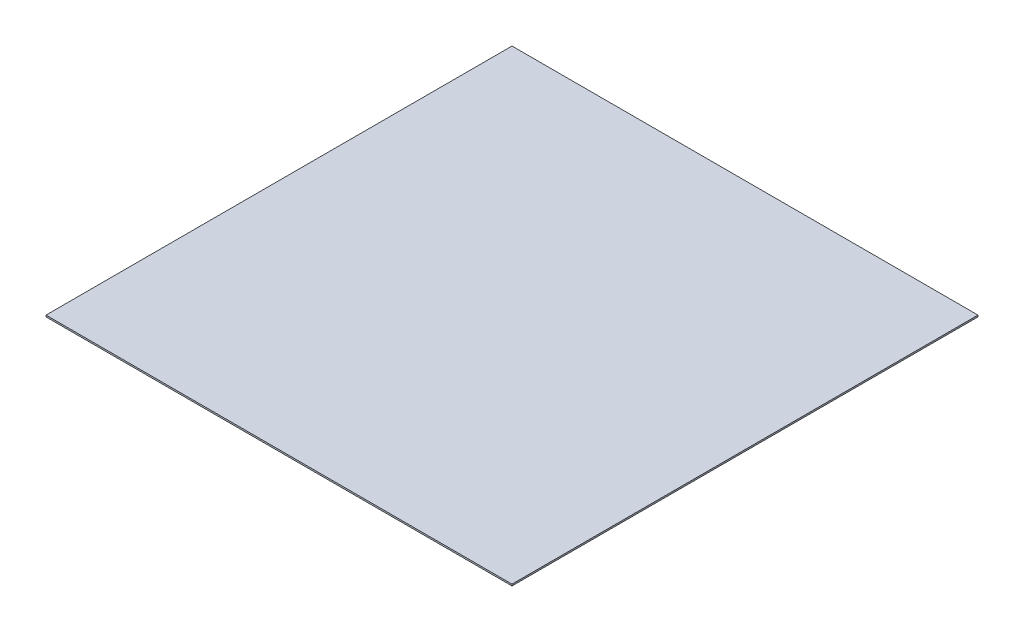
ISO-10303-21;
HEADER;
FILE_DESCRIPTION(('STEP AP214'),'2;1');
FILE_NAME('part.step','',(''),(''),'','','');
FILE_SCHEMA(('AUTOMOTIVE_DESIGN { 1 0 10303 214 1 1 1 1 }'));
ENDSEC;
DATA;
#1=APPLICATION_CONTEXT('core data for automotive mechanical design processes');
#2=APPLICATION_PROTOCOL_DEFINITION('international standard','automotive_design',2000,#1);
#3=PRODUCT_CONTEXT('',#1,'mechanical');
#4=PRODUCT('Part','Part','',(#3));
#5=PRODUCT_RELATED_PRODUCT_CATEGORY('part','',(#4));
#6=PRODUCT_DEFINITION_FORMATION('','',#4);
#7=PRODUCT_DEFINITION_CONTEXT('part definition',#1,'design');
#8=PRODUCT_DEFINITION('design','',#6,#7);
#9=PRODUCT_DEFINITION_SHAPE('','',#8);
#10=(LENGTH_UNIT() NAMED_UNIT(*) SI_UNIT(.MILLI.,.METRE.));
#11=(NAMED_UNIT(*) PLANE_ANGLE_UNIT() SI_UNIT($,.RADIAN.));
#12=(NAMED_UNIT(*) SI_UNIT($,.STERADIAN.) SOLID_ANGLE_UNIT());
#13=UNCERTAINTY_MEASURE_WITH_UNIT(LENGTH_MEASURE(1.E-05),#10,'distance_accuracy_value','');
#14=(GEOMETRIC_REPRESENTATION_CONTEXT(3) GLOBAL_UNCERTAINTY_ASSIGNED_CONTEXT((#13)) GLOBAL_UNIT_ASSIGNED_CONTEXT((#10,
#11,#12)) REPRESENTATION_CONTEXT('',''));
#15=CARTESIAN_POINT('',(0.,0.,0.));
#16=DIRECTION('',(0.,0.,1.));
#17=DIRECTION('',(1.,0.,0.));
#18=AXIS2_PLACEMENT_3D('',#15,#16,#17);
#19=CARTESIAN_POINT('',(-435.,3.,435.));
#20=DIRECTION('',(1.,0.,0.));
#21=DIRECTION('',(0.,0.,-1.));
#22=AXIS2_PLACEMENT_3D('',#19,#20,#21);
#23=PLANE('',#22);
#24=DIRECTION('',(0.,0.,1.));
#25=VECTOR('',#24,1.);
#26=CARTESIAN_POINT('',(-435.,0.,435.));
#27=LINE('',#26,#25);
#28=CARTESIAN_POINT('',(-435.,0.,-435.));
#29=VERTEX_POINT('',#28);
#30=CARTESIAN_POINT('',(-435.,0.,435.));
#31=VERTEX_POINT('',#30);
#32=EDGE_CURVE('E99',#29,#31,#27,.T.);
#33=ORIENTED_EDGE('',*,*,#32,.T.);
#34=DIRECTION('',(0.,-1.,0.));
#35=VECTOR('',#34,1.);
#36=CARTESIAN_POINT('',(-435.,3.,435.));
#37=LINE('',#36,#35);
#38=CARTESIAN_POINT('',(-435.,3.,435.));
#39=VERTEX_POINT('',#38);
#40=EDGE_CURVE('E11',#39,#31,#37,.T.);
#41=ORIENTED_EDGE('',*,*,#40,.F.);
#42=DIRECTION('',(0.,0.,1.));
#43=VECTOR('',#42,1.);
#44=CARTESIAN_POINT('',(-435.,3.,435.));
#45=LINE('',#44,#43);
#46=CARTESIAN_POINT('',(-435.,3.,-435.));
#47=VERTEX_POINT('',#46);
#48=EDGE_CURVE('E87',#47,#39,#45,.T.);
#49=ORIENTED_EDGE('',*,*,#48,.F.);
#50=DIRECTION('',(0.,-1.,0.));
#51=VECTOR('',#50,1.);
#52=CARTESIAN_POINT('',(-435.,3.,-435.));
#53=LINE('',#52,#51);
#54=EDGE_CURVE('E95',#47,#29,#53,.T.);
#55=ORIENTED_EDGE('',*,*,#54,.T.);
#56=EDGE_LOOP('',(#33,#41,#49,#55));
#57=FACE_BOUND('',#56,.T.);
#58=ADVANCED_FACE('F36',(#57),#23,.F.);
#59=CARTESIAN_POINT('',(435.,3.,435.));
#60=DIRECTION('',(0.,0.,-1.));
#61=DIRECTION('',(-1.,0.,0.));
#62=AXIS2_PLACEMENT_3D('',#59,#60,#61);
#63=PLANE('',#62);
#64=DIRECTION('',(1.,0.,0.));
#65=VECTOR('',#64,1.);
#66=CARTESIAN_POINT('',(435.,0.,435.));
#67=LINE('',#66,#65);
#68=CARTESIAN_POINT('',(435.,0.,435.));
#69=VERTEX_POINT('',#68);
#70=EDGE_CURVE('E91',#31,#69,#67,.T.);
#71=ORIENTED_EDGE('',*,*,#70,.T.);
#72=DIRECTION('',(0.,-1.,0.));
#73=VECTOR('',#72,1.);
#74=CARTESIAN_POINT('',(435.,3.,435.));
#75=LINE('',#74,#73);
#76=CARTESIAN_POINT('',(435.,3.,435.));
#77=VERTEX_POINT('',#76);
#78=EDGE_CURVE('E44',#77,#69,#75,.T.);
#79=ORIENTED_EDGE('',*,*,#78,.F.);
#80=DIRECTION('',(1.,0.,0.));
#81=VECTOR('',#80,1.);
#82=CARTESIAN_POINT('',(435.,3.,435.));
#83=LINE('',#82,#81);
#84=EDGE_CURVE('E82',#39,#77,#83,.T.);
#85=ORIENTED_EDGE('',*,*,#84,.F.);
#86=ORIENTED_EDGE('',*,*,#40,.T.);
#87=EDGE_LOOP('',(#71,#79,#85,#86));
#88=FACE_BOUND('',#87,.T.);
#89=ADVANCED_FACE('F90',(#88),#63,.F.);
#90=CARTESIAN_POINT('',(435.,3.,435.));
#91=DIRECTION('',(-1.,0.,0.));
#92=DIRECTION('',(0.,0.,1.));
#93=AXIS2_PLACEMENT_3D('',#90,#91,#92);
#94=PLANE('',#93);
#95=DIRECTION('',(0.,0.,-1.));
#96=VECTOR('',#95,1.);
#97=CARTESIAN_POINT('',(435.,0.,435.));
#98=LINE('',#97,#96);
#99=CARTESIAN_POINT('',(435.,0.,-435.));
#100=VERTEX_POINT('',#99);
#101=EDGE_CURVE('E69',#69,#100,#98,.T.);
#102=ORIENTED_EDGE('',*,*,#101,.T.);
#103=DIRECTION('',(0.,-1.,0.));
#104=VECTOR('',#103,1.);
#105=CARTESIAN_POINT('',(435.,3.,-435.));
#106=LINE('',#105,#104);
#107=CARTESIAN_POINT('',(435.,3.,-435.));
#108=VERTEX_POINT('',#107);
#109=EDGE_CURVE('E92',#108,#100,#106,.T.);
#110=ORIENTED_EDGE('',*,*,#109,.F.);
#111=DIRECTION('',(0.,0.,-1.));
#112=VECTOR('',#111,1.);
#113=CARTESIAN_POINT('',(435.,3.,435.));
#114=LINE('',#113,#112);
#115=EDGE_CURVE('E85',#77,#108,#114,.T.);
#116=ORIENTED_EDGE('',*,*,#115,.F.);
#117=ORIENTED_EDGE('',*,*,#78,.T.);
#118=EDGE_LOOP('',(#102,#110,#116,#117));
#119=FACE_BOUND('',#118,.T.);
#120=ADVANCED_FACE('F93',(#119),#94,.F.);
#121=CARTESIAN_POINT('',(435.,3.,-435.));
#122=DIRECTION('',(0.,0.,1.));
#123=DIRECTION('',(1.,0.,0.));
#124=AXIS2_PLACEMENT_3D('',#121,#122,#123);
#125=PLANE('',#124);
#126=DIRECTION('',(-1.,0.,0.));
#127=VECTOR('',#126,1.);
#128=CARTESIAN_POINT('',(435.,0.,-435.));
#129=LINE('',#128,#127);
#130=EDGE_CURVE('E75',#100,#29,#129,.T.);
#131=ORIENTED_EDGE('',*,*,#130,.T.);
#132=ORIENTED_EDGE('',*,*,#54,.F.);
#133=DIRECTION('',(-1.,0.,0.));
#134=VECTOR('',#133,1.);
#135=CARTESIAN_POINT('',(435.,3.,-435.));
#136=LINE('',#135,#134);
#137=EDGE_CURVE('E52',#108,#47,#136,.T.);
#138=ORIENTED_EDGE('',*,*,#137,.F.);
#139=ORIENTED_EDGE('',*,*,#109,.T.);
#140=EDGE_LOOP('',(#131,#132,#138,#139));
#141=FACE_BOUND('',#140,.T.);
#142=ADVANCED_FACE('F106',(#141),#125,.F.);
#143=CARTESIAN_POINT('',(0.,3.,0.));
#144=DIRECTION('',(0.,1.,0.));
#145=DIRECTION('',(0.,0.,1.));
#146=AXIS2_PLACEMENT_3D('',#143,#144,#145);
#147=PLANE('',#146);
#148=ORIENTED_EDGE('',*,*,#48,.T.);
#149=ORIENTED_EDGE('',*,*,#84,.T.);
#150=ORIENTED_EDGE('',*,*,#115,.T.);
#151=ORIENTED_EDGE('',*,*,#137,.T.);
#152=EDGE_LOOP('',(#148,#149,#150,#151));
#153=FACE_BOUND('',#152,.T.);
#154=ADVANCED_FACE('F83',(#153),#147,.T.);
#155=CARTESIAN_POINT('',(0.,0.,0.));
#156=DIRECTION('',(0.,1.,0.));
#157=DIRECTION('',(0.,0.,1.));
#158=AXIS2_PLACEMENT_3D('',#155,#156,#157);
#159=PLANE('',#158);
#160=ORIENTED_EDGE('',*,*,#32,.F.);
#161=ORIENTED_EDGE('',*,*,#130,.F.);
#162=ORIENTED_EDGE('',*,*,#101,.F.);
#163=ORIENTED_EDGE('',*,*,#70,.F.);
#164=EDGE_LOOP('',(#160,#161,#162,#163));
#165=FACE_BOUND('',#164,.T.);
#166=ADVANCED_FACE('F109',(#165),#159,.F.);
#167=CLOSED_SHELL('',(#58,#89,#120,#142,#154,#166));
#168=MANIFOLD_SOLID_BREP('B2',#167);
#169=ADVANCED_BREP_SHAPE_REPRESENTATION('',(#18,#168),#14);
#170=SHAPE_DEFINITION_REPRESENTATION(#9,#169);
ENDSEC;
END-ISO-10303-21;
